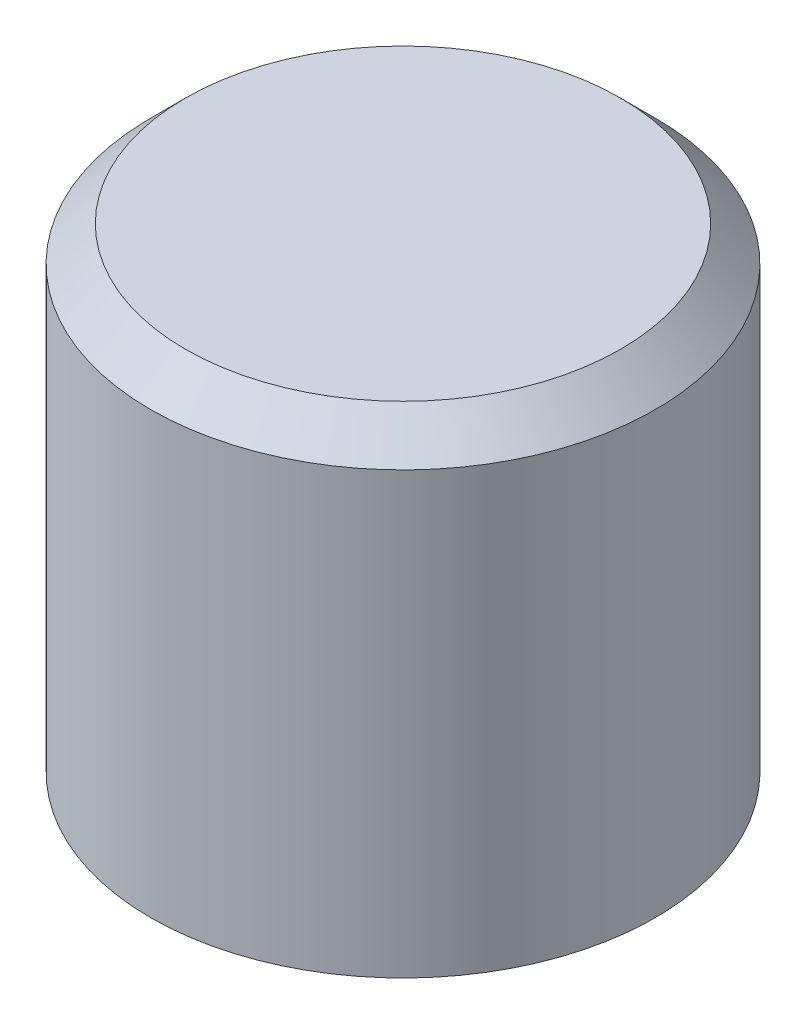
ISO-10303-21;
HEADER;
FILE_DESCRIPTION(('STEP AP214'),'2;1');
FILE_NAME('part.step','',(''),(''),'','','');
FILE_SCHEMA(('AUTOMOTIVE_DESIGN { 1 0 10303 214 1 1 1 1 }'));
ENDSEC;
DATA;
#1=APPLICATION_CONTEXT('core data for automotive mechanical design processes');
#2=APPLICATION_PROTOCOL_DEFINITION('international standard','automotive_design',2000,#1);
#3=PRODUCT_CONTEXT('',#1,'mechanical');
#4=PRODUCT('Part','Part','',(#3));
#5=PRODUCT_RELATED_PRODUCT_CATEGORY('part','',(#4));
#6=PRODUCT_DEFINITION_FORMATION('','',#4);
#7=PRODUCT_DEFINITION_CONTEXT('part definition',#1,'design');
#8=PRODUCT_DEFINITION('design','',#6,#7);
#9=PRODUCT_DEFINITION_SHAPE('','',#8);
#10=(LENGTH_UNIT() NAMED_UNIT(*) SI_UNIT(.MILLI.,.METRE.));
#11=(NAMED_UNIT(*) PLANE_ANGLE_UNIT() SI_UNIT($,.RADIAN.));
#12=(NAMED_UNIT(*) SI_UNIT($,.STERADIAN.) SOLID_ANGLE_UNIT());
#13=UNCERTAINTY_MEASURE_WITH_UNIT(LENGTH_MEASURE(1.E-05),#10,'distance_accuracy_value','');
#14=(GEOMETRIC_REPRESENTATION_CONTEXT(3) GLOBAL_UNCERTAINTY_ASSIGNED_CONTEXT((#13)) GLOBAL_UNIT_ASSIGNED_CONTEXT((#10,
#11,#12)) REPRESENTATION_CONTEXT('',''));
#15=CARTESIAN_POINT('',(0.,0.,0.));
#16=DIRECTION('',(0.,0.,1.));
#17=DIRECTION('',(1.,0.,0.));
#18=AXIS2_PLACEMENT_3D('',#15,#16,#17);
#19=CARTESIAN_POINT('',(0.,6.82,0.));
#20=DIRECTION('',(0.,-1.,0.));
#21=DIRECTION('',(0.,0.,-1.));
#22=AXIS2_PLACEMENT_3D('',#19,#20,#21);
#23=CYLINDRICAL_SURFACE('',#22,3.625);
#24=CARTESIAN_POINT('',(0.,6.32,0.));
#25=DIRECTION('',(0.,1.,0.));
#26=DIRECTION('',(0.,0.,1.));
#27=AXIS2_PLACEMENT_3D('',#24,#25,#26);
#28=CIRCLE('',#27,3.625);
#29=CARTESIAN_POINT('',(0.,6.32,3.625));
#30=VERTEX_POINT('',#29);
#31=EDGE_CURVE('E12',#30,#30,#28,.F.);
#32=ORIENTED_EDGE('',*,*,#31,.T.);
#33=EDGE_LOOP('',(#32));
#34=FACE_BOUND('',#33,.T.);
#35=CARTESIAN_POINT('',(0.,0.,0.));
#36=DIRECTION('',(0.,1.,0.));
#37=DIRECTION('',(0.,0.,1.));
#38=AXIS2_PLACEMENT_3D('',#35,#36,#37);
#39=CIRCLE('',#38,3.625);
#40=CARTESIAN_POINT('',(0.,0.,3.625));
#41=VERTEX_POINT('',#40);
#42=EDGE_CURVE('E113',#41,#41,#39,.T.);
#43=ORIENTED_EDGE('',*,*,#42,.T.);
#44=EDGE_LOOP('',(#43));
#45=FACE_BOUND('',#44,.T.);
#46=ADVANCED_FACE('F37',(#34,#45),#23,.T.);
#47=CARTESIAN_POINT('',(0.,6.82,0.));
#48=DIRECTION('',(0.,1.,0.));
#49=DIRECTION('',(0.,0.,1.));
#50=AXIS2_PLACEMENT_3D('',#47,#48,#49);
#51=PLANE('',#50);
#52=CARTESIAN_POINT('',(0.,6.82,0.));
#53=DIRECTION('',(0.,1.,0.));
#54=DIRECTION('',(0.,0.,1.));
#55=AXIS2_PLACEMENT_3D('',#52,#53,#54);
#56=CIRCLE('',#55,3.125);
#57=CARTESIAN_POINT('',(0.,6.82,3.125));
#58=VERTEX_POINT('',#57);
#59=EDGE_CURVE('E45',#58,#58,#56,.T.);
#60=ORIENTED_EDGE('',*,*,#59,.T.);
#61=EDGE_LOOP('',(#60));
#62=FACE_BOUND('',#61,.T.);
#63=ADVANCED_FACE('F118',(#62),#51,.T.);
#64=CARTESIAN_POINT('',(0.,0.,0.));
#65=DIRECTION('',(0.,1.,0.));
#66=DIRECTION('',(0.,0.,1.));
#67=AXIS2_PLACEMENT_3D('',#64,#65,#66);
#68=PLANE('',#67);
#69=DIRECTION('',(0.,0.,-1.));
#70=VECTOR('',#69,1.);
#71=CARTESIAN_POINT('',(-1.6,0.,1.6));
#72=LINE('',#71,#70);
#73=CARTESIAN_POINT('',(-1.6,0.,1.6));
#74=VERTEX_POINT('',#73);
#75=CARTESIAN_POINT('',(-1.6,0.,-1.6));
#76=VERTEX_POINT('',#75);
#77=EDGE_CURVE('E100',#74,#76,#72,.T.);
#78=ORIENTED_EDGE('',*,*,#77,.F.);
#79=DIRECTION('',(-1.,0.,0.));
#80=VECTOR('',#79,1.);
#81=CARTESIAN_POINT('',(-1.6,0.,1.6));
#82=LINE('',#81,#80);
#83=CARTESIAN_POINT('',(1.6,0.,1.6));
#84=VERTEX_POINT('',#83);
#85=EDGE_CURVE('E94',#84,#74,#82,.T.);
#86=ORIENTED_EDGE('',*,*,#85,.F.);
#87=DIRECTION('',(0.,0.,1.));
#88=VECTOR('',#87,1.);
#89=CARTESIAN_POINT('',(1.6,0.,1.6));
#90=LINE('',#89,#88);
#91=CARTESIAN_POINT('',(1.6,0.,-1.6));
#92=VERTEX_POINT('',#91);
#93=EDGE_CURVE('E104',#92,#84,#90,.T.);
#94=ORIENTED_EDGE('',*,*,#93,.F.);
#95=DIRECTION('',(1.,0.,0.));
#96=VECTOR('',#95,1.);
#97=CARTESIAN_POINT('',(-1.6,0.,-1.6));
#98=LINE('',#97,#96);
#99=EDGE_CURVE('E52',#76,#92,#98,.T.);
#100=ORIENTED_EDGE('',*,*,#99,.F.);
#101=EDGE_LOOP('',(#78,#86,#94,#100));
#102=FACE_BOUND('',#101,.T.);
#103=ORIENTED_EDGE('',*,*,#42,.F.);
#104=EDGE_LOOP('',(#103));
#105=FACE_BOUND('',#104,.T.);
#106=ADVANCED_FACE('F121',(#102,#105),#68,.F.);
#107=CARTESIAN_POINT('',(0.,6.82,0.));
#108=DIRECTION('',(0.,-1.,0.));
#109=DIRECTION('',(0.,0.,-1.));
#110=AXIS2_PLACEMENT_3D('',#107,#108,#109);
#111=CONICAL_SURFACE('',#110,3.125,0.785398163397447);
#112=ORIENTED_EDGE('',*,*,#31,.F.);
#113=EDGE_LOOP('',(#112));
#114=FACE_BOUND('',#113,.T.);
#115=ORIENTED_EDGE('',*,*,#59,.F.);
#116=EDGE_LOOP('',(#115));
#117=FACE_BOUND('',#116,.T.);
#118=ADVANCED_FACE('F39',(#114,#117),#111,.T.);
#119=CARTESIAN_POINT('',(0.,2.93,0.));
#120=DIRECTION('',(0.,1.,0.));
#121=DIRECTION('',(0.,0.,1.));
#122=AXIS2_PLACEMENT_3D('',#119,#120,#121);
#123=PLANE('',#122);
#124=DIRECTION('',(0.,0.,1.));
#125=VECTOR('',#124,1.);
#126=CARTESIAN_POINT('',(1.6,2.93,1.6));
#127=LINE('',#126,#125);
#128=CARTESIAN_POINT('',(1.6,2.93,-1.6));
#129=VERTEX_POINT('',#128);
#130=CARTESIAN_POINT('',(1.6,2.93,1.6));
#131=VERTEX_POINT('',#130);
#132=EDGE_CURVE('E98',#129,#131,#127,.T.);
#133=ORIENTED_EDGE('',*,*,#132,.T.);
#134=DIRECTION('',(-1.,0.,0.));
#135=VECTOR('',#134,1.);
#136=CARTESIAN_POINT('',(-1.6,2.93,1.6));
#137=LINE('',#136,#135);
#138=CARTESIAN_POINT('',(-1.6,2.93,1.6));
#139=VERTEX_POINT('',#138);
#140=EDGE_CURVE('E76',#131,#139,#137,.T.);
#141=ORIENTED_EDGE('',*,*,#140,.T.);
#142=DIRECTION('',(0.,0.,-1.));
#143=VECTOR('',#142,1.);
#144=CARTESIAN_POINT('',(-1.6,2.93,1.6));
#145=LINE('',#144,#143);
#146=CARTESIAN_POINT('',(-1.6,2.93,-1.6));
#147=VERTEX_POINT('',#146);
#148=EDGE_CURVE('E84',#139,#147,#145,.T.);
#149=ORIENTED_EDGE('',*,*,#148,.T.);
#150=DIRECTION('',(1.,0.,0.));
#151=VECTOR('',#150,1.);
#152=CARTESIAN_POINT('',(-1.6,2.93,-1.6));
#153=LINE('',#152,#151);
#154=EDGE_CURVE('E108',#147,#129,#153,.T.);
#155=ORIENTED_EDGE('',*,*,#154,.T.);
#156=EDGE_LOOP('',(#133,#141,#149,#155));
#157=FACE_BOUND('',#156,.T.);
#158=ADVANCED_FACE('F97',(#157),#123,.F.);
#159=CARTESIAN_POINT('',(-1.6,11.3454833995939,1.6));
#160=DIRECTION('',(0.,0.,1.));
#161=DIRECTION('',(1.,0.,0.));
#162=AXIS2_PLACEMENT_3D('',#159,#160,#161);
#163=PLANE('',#162);
#164=DIRECTION('',(0.,-1.,0.));
#165=VECTOR('',#164,1.);
#166=CARTESIAN_POINT('',(1.6,11.3454833995939,1.6));
#167=LINE('',#166,#165);
#168=EDGE_CURVE('E61',#131,#84,#167,.T.);
#169=ORIENTED_EDGE('',*,*,#168,.T.);
#170=ORIENTED_EDGE('',*,*,#85,.T.);
#171=DIRECTION('',(0.,-1.,0.));
#172=VECTOR('',#171,1.);
#173=CARTESIAN_POINT('',(-1.6,11.3454833995939,1.6));
#174=LINE('',#173,#172);
#175=EDGE_CURVE('E87',#139,#74,#174,.T.);
#176=ORIENTED_EDGE('',*,*,#175,.F.);
#177=ORIENTED_EDGE('',*,*,#140,.F.);
#178=EDGE_LOOP('',(#169,#170,#176,#177));
#179=FACE_BOUND('',#178,.T.);
#180=ADVANCED_FACE('F92',(#179),#163,.F.);
#181=CARTESIAN_POINT('',(-1.6,11.3454833995939,1.6));
#182=DIRECTION('',(-1.,0.,0.));
#183=DIRECTION('',(0.,0.,1.));
#184=AXIS2_PLACEMENT_3D('',#181,#182,#183);
#185=PLANE('',#184);
#186=ORIENTED_EDGE('',*,*,#175,.T.);
#187=ORIENTED_EDGE('',*,*,#77,.T.);
#188=DIRECTION('',(0.,-1.,0.));
#189=VECTOR('',#188,1.);
#190=CARTESIAN_POINT('',(-1.6,11.3454833995939,-1.6));
#191=LINE('',#190,#189);
#192=EDGE_CURVE('E88',#147,#76,#191,.T.);
#193=ORIENTED_EDGE('',*,*,#192,.F.);
#194=ORIENTED_EDGE('',*,*,#148,.F.);
#195=EDGE_LOOP('',(#186,#187,#193,#194));
#196=FACE_BOUND('',#195,.T.);
#197=ADVANCED_FACE('F85',(#196),#185,.F.);
#198=CARTESIAN_POINT('',(-1.6,11.3454833995939,-1.6));
#199=DIRECTION('',(0.,0.,-1.));
#200=DIRECTION('',(-1.,0.,0.));
#201=AXIS2_PLACEMENT_3D('',#198,#199,#200);
#202=PLANE('',#201);
#203=ORIENTED_EDGE('',*,*,#192,.T.);
#204=ORIENTED_EDGE('',*,*,#99,.T.);
#205=DIRECTION('',(0.,-1.,0.));
#206=VECTOR('',#205,1.);
#207=CARTESIAN_POINT('',(1.6,11.3454833995939,-1.6));
#208=LINE('',#207,#206);
#209=EDGE_CURVE('E107',#129,#92,#208,.T.);
#210=ORIENTED_EDGE('',*,*,#209,.F.);
#211=ORIENTED_EDGE('',*,*,#154,.F.);
#212=EDGE_LOOP('',(#203,#204,#210,#211));
#213=FACE_BOUND('',#212,.T.);
#214=ADVANCED_FACE('F143',(#213),#202,.F.);
#215=CARTESIAN_POINT('',(1.6,11.3454833995939,1.6));
#216=DIRECTION('',(1.,0.,0.));
#217=DIRECTION('',(0.,0.,-1.));
#218=AXIS2_PLACEMENT_3D('',#215,#216,#217);
#219=PLANE('',#218);
#220=ORIENTED_EDGE('',*,*,#209,.T.);
#221=ORIENTED_EDGE('',*,*,#93,.T.);
#222=ORIENTED_EDGE('',*,*,#168,.F.);
#223=ORIENTED_EDGE('',*,*,#132,.F.);
#224=EDGE_LOOP('',(#220,#221,#222,#223));
#225=FACE_BOUND('',#224,.T.);
#226=ADVANCED_FACE('F146',(#225),#219,.F.);
#227=CLOSED_SHELL('',(#46,#63,#106,#118,#158,#180,#197,#214,#226));
#228=MANIFOLD_SOLID_BREP('B2',#227);
#229=ADVANCED_BREP_SHAPE_REPRESENTATION('',(#18,#228),#14);
#230=SHAPE_DEFINITION_REPRESENTATION(#9,#229);
ENDSEC;
END-ISO-10303-21;
